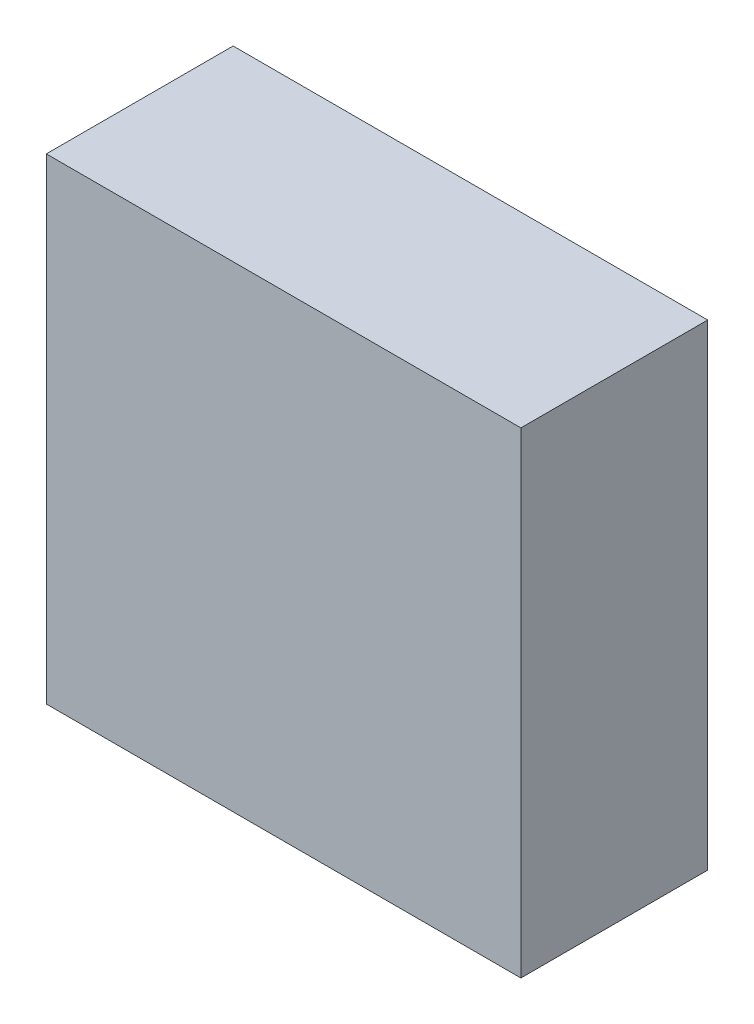
ISO-10303-21;
HEADER;
FILE_DESCRIPTION(('STEP AP214'),'2;1');
FILE_NAME('part.step','',(''),(''),'','','');
FILE_SCHEMA(('AUTOMOTIVE_DESIGN { 1 0 10303 214 1 1 1 1 }'));
ENDSEC;
DATA;
#1=APPLICATION_CONTEXT('core data for automotive mechanical design processes');
#2=APPLICATION_PROTOCOL_DEFINITION('international standard','automotive_design',2000,#1);
#3=PRODUCT_CONTEXT('',#1,'mechanical');
#4=PRODUCT('Part','Part','',(#3));
#5=PRODUCT_RELATED_PRODUCT_CATEGORY('part','',(#4));
#6=PRODUCT_DEFINITION_FORMATION('','',#4);
#7=PRODUCT_DEFINITION_CONTEXT('part definition',#1,'design');
#8=PRODUCT_DEFINITION('design','',#6,#7);
#9=PRODUCT_DEFINITION_SHAPE('','',#8);
#10=(LENGTH_UNIT() NAMED_UNIT(*) SI_UNIT(.MILLI.,.METRE.));
#11=(NAMED_UNIT(*) PLANE_ANGLE_UNIT() SI_UNIT($,.RADIAN.));
#12=(NAMED_UNIT(*) SI_UNIT($,.STERADIAN.) SOLID_ANGLE_UNIT());
#13=UNCERTAINTY_MEASURE_WITH_UNIT(LENGTH_MEASURE(1.E-05),#10,'distance_accuracy_value','');
#14=(GEOMETRIC_REPRESENTATION_CONTEXT(3) GLOBAL_UNCERTAINTY_ASSIGNED_CONTEXT((#13)) GLOBAL_UNIT_ASSIGNED_CONTEXT((#10,
#11,#12)) REPRESENTATION_CONTEXT('',''));
#15=CARTESIAN_POINT('',(0.,0.,0.));
#16=DIRECTION('',(0.,0.,1.));
#17=DIRECTION('',(1.,0.,0.));
#18=AXIS2_PLACEMENT_3D('',#15,#16,#17);
#19=CARTESIAN_POINT('',(-12.7,12.75,10.));
#20=DIRECTION('',(1.,0.,0.));
#21=DIRECTION('',(0.,0.,-1.));
#22=AXIS2_PLACEMENT_3D('',#19,#20,#21);
#23=PLANE('',#22);
#24=DIRECTION('',(0.,-1.,0.));
#25=VECTOR('',#24,1.);
#26=CARTESIAN_POINT('',(-12.7,12.75,0.));
#27=LINE('',#26,#25);
#28=CARTESIAN_POINT('',(-12.7,12.75,0.));
#29=VERTEX_POINT('',#28);
#30=CARTESIAN_POINT('',(-12.7,-12.75,0.));
#31=VERTEX_POINT('',#30);
#32=EDGE_CURVE('E98',#29,#31,#27,.T.);
#33=ORIENTED_EDGE('',*,*,#32,.T.);
#34=DIRECTION('',(0.,0.,-1.));
#35=VECTOR('',#34,1.);
#36=CARTESIAN_POINT('',(-12.7,-12.75,10.));
#37=LINE('',#36,#35);
#38=CARTESIAN_POINT('',(-12.7,-12.75,10.));
#39=VERTEX_POINT('',#38);
#40=EDGE_CURVE('E11',#39,#31,#37,.T.);
#41=ORIENTED_EDGE('',*,*,#40,.F.);
#42=DIRECTION('',(0.,-1.,0.));
#43=VECTOR('',#42,1.);
#44=CARTESIAN_POINT('',(-12.7,12.75,10.));
#45=LINE('',#44,#43);
#46=CARTESIAN_POINT('',(-12.7,12.75,10.));
#47=VERTEX_POINT('',#46);
#48=EDGE_CURVE('E86',#47,#39,#45,.T.);
#49=ORIENTED_EDGE('',*,*,#48,.F.);
#50=DIRECTION('',(0.,0.,-1.));
#51=VECTOR('',#50,1.);
#52=CARTESIAN_POINT('',(-12.7,12.75,10.));
#53=LINE('',#52,#51);
#54=EDGE_CURVE('E94',#47,#29,#53,.T.);
#55=ORIENTED_EDGE('',*,*,#54,.T.);
#56=EDGE_LOOP('',(#33,#41,#49,#55));
#57=FACE_BOUND('',#56,.T.);
#58=ADVANCED_FACE('F35',(#57),#23,.F.);
#59=CARTESIAN_POINT('',(-12.7,-12.75,10.));
#60=DIRECTION('',(0.,1.,0.));
#61=DIRECTION('',(0.,0.,1.));
#62=AXIS2_PLACEMENT_3D('',#59,#60,#61);
#63=PLANE('',#62);
#64=DIRECTION('',(1.,0.,0.));
#65=VECTOR('',#64,1.);
#66=CARTESIAN_POINT('',(-12.7,-12.75,0.));
#67=LINE('',#66,#65);
#68=CARTESIAN_POINT('',(12.7,-12.75,0.));
#69=VERTEX_POINT('',#68);
#70=EDGE_CURVE('E90',#31,#69,#67,.T.);
#71=ORIENTED_EDGE('',*,*,#70,.T.);
#72=DIRECTION('',(0.,0.,-1.));
#73=VECTOR('',#72,1.);
#74=CARTESIAN_POINT('',(12.7,-12.75,10.));
#75=LINE('',#74,#73);
#76=CARTESIAN_POINT('',(12.7,-12.75,10.));
#77=VERTEX_POINT('',#76);
#78=EDGE_CURVE('E43',#77,#69,#75,.T.);
#79=ORIENTED_EDGE('',*,*,#78,.F.);
#80=DIRECTION('',(1.,0.,0.));
#81=VECTOR('',#80,1.);
#82=CARTESIAN_POINT('',(-12.7,-12.75,10.));
#83=LINE('',#82,#81);
#84=EDGE_CURVE('E81',#39,#77,#83,.T.);
#85=ORIENTED_EDGE('',*,*,#84,.F.);
#86=ORIENTED_EDGE('',*,*,#40,.T.);
#87=EDGE_LOOP('',(#71,#79,#85,#86));
#88=FACE_BOUND('',#87,.T.);
#89=ADVANCED_FACE('F89',(#88),#63,.F.);
#90=CARTESIAN_POINT('',(12.7,12.75,10.));
#91=DIRECTION('',(-1.,0.,0.));
#92=DIRECTION('',(0.,0.,1.));
#93=AXIS2_PLACEMENT_3D('',#90,#91,#92);
#94=PLANE('',#93);
#95=DIRECTION('',(0.,1.,0.));
#96=VECTOR('',#95,1.);
#97=CARTESIAN_POINT('',(12.7,12.75,0.));
#98=LINE('',#97,#96);
#99=CARTESIAN_POINT('',(12.7,12.75,0.));
#100=VERTEX_POINT('',#99);
#101=EDGE_CURVE('E68',#69,#100,#98,.T.);
#102=ORIENTED_EDGE('',*,*,#101,.T.);
#103=DIRECTION('',(0.,0.,-1.));
#104=VECTOR('',#103,1.);
#105=CARTESIAN_POINT('',(12.7,12.75,10.));
#106=LINE('',#105,#104);
#107=CARTESIAN_POINT('',(12.7,12.75,10.));
#108=VERTEX_POINT('',#107);
#109=EDGE_CURVE('E91',#108,#100,#106,.T.);
#110=ORIENTED_EDGE('',*,*,#109,.F.);
#111=DIRECTION('',(0.,1.,0.));
#112=VECTOR('',#111,1.);
#113=CARTESIAN_POINT('',(12.7,12.75,10.));
#114=LINE('',#113,#112);
#115=EDGE_CURVE('E84',#77,#108,#114,.T.);
#116=ORIENTED_EDGE('',*,*,#115,.F.);
#117=ORIENTED_EDGE('',*,*,#78,.T.);
#118=EDGE_LOOP('',(#102,#110,#116,#117));
#119=FACE_BOUND('',#118,.T.);
#120=ADVANCED_FACE('F92',(#119),#94,.F.);
#121=CARTESIAN_POINT('',(-12.7,12.75,10.));
#122=DIRECTION('',(0.,-1.,0.));
#123=DIRECTION('',(0.,0.,-1.));
#124=AXIS2_PLACEMENT_3D('',#121,#122,#123);
#125=PLANE('',#124);
#126=DIRECTION('',(-1.,0.,0.));
#127=VECTOR('',#126,1.);
#128=CARTESIAN_POINT('',(-12.7,12.75,0.));
#129=LINE('',#128,#127);
#130=EDGE_CURVE('E74',#100,#29,#129,.T.);
#131=ORIENTED_EDGE('',*,*,#130,.T.);
#132=ORIENTED_EDGE('',*,*,#54,.F.);
#133=DIRECTION('',(-1.,0.,0.));
#134=VECTOR('',#133,1.);
#135=CARTESIAN_POINT('',(-12.7,12.75,10.));
#136=LINE('',#135,#134);
#137=EDGE_CURVE('E51',#108,#47,#136,.T.);
#138=ORIENTED_EDGE('',*,*,#137,.F.);
#139=ORIENTED_EDGE('',*,*,#109,.T.);
#140=EDGE_LOOP('',(#131,#132,#138,#139));
#141=FACE_BOUND('',#140,.T.);
#142=ADVANCED_FACE('F105',(#141),#125,.F.);
#143=CARTESIAN_POINT('',(0.,0.,10.));
#144=DIRECTION('',(0.,0.,1.));
#145=DIRECTION('',(1.,0.,0.));
#146=AXIS2_PLACEMENT_3D('',#143,#144,#145);
#147=PLANE('',#146);
#148=ORIENTED_EDGE('',*,*,#48,.T.);
#149=ORIENTED_EDGE('',*,*,#84,.T.);
#150=ORIENTED_EDGE('',*,*,#115,.T.);
#151=ORIENTED_EDGE('',*,*,#137,.T.);
#152=EDGE_LOOP('',(#148,#149,#150,#151));
#153=FACE_BOUND('',#152,.T.);
#154=ADVANCED_FACE('F82',(#153),#147,.T.);
#155=CARTESIAN_POINT('',(0.,0.,0.));
#156=DIRECTION('',(0.,0.,1.));
#157=DIRECTION('',(1.,0.,0.));
#158=AXIS2_PLACEMENT_3D('',#155,#156,#157);
#159=PLANE('',#158);
#160=ORIENTED_EDGE('',*,*,#32,.F.);
#161=ORIENTED_EDGE('',*,*,#130,.F.);
#162=ORIENTED_EDGE('',*,*,#101,.F.);
#163=ORIENTED_EDGE('',*,*,#70,.F.);
#164=EDGE_LOOP('',(#160,#161,#162,#163));
#165=FACE_BOUND('',#164,.T.);
#166=ADVANCED_FACE('F108',(#165),#159,.F.);
#167=CLOSED_SHELL('',(#58,#89,#120,#142,#154,#166));
#168=MANIFOLD_SOLID_BREP('B2',#167);
#169=ADVANCED_BREP_SHAPE_REPRESENTATION('',(#18,#168),#14);
#170=SHAPE_DEFINITION_REPRESENTATION(#9,#169);
ENDSEC;
END-ISO-10303-21;
